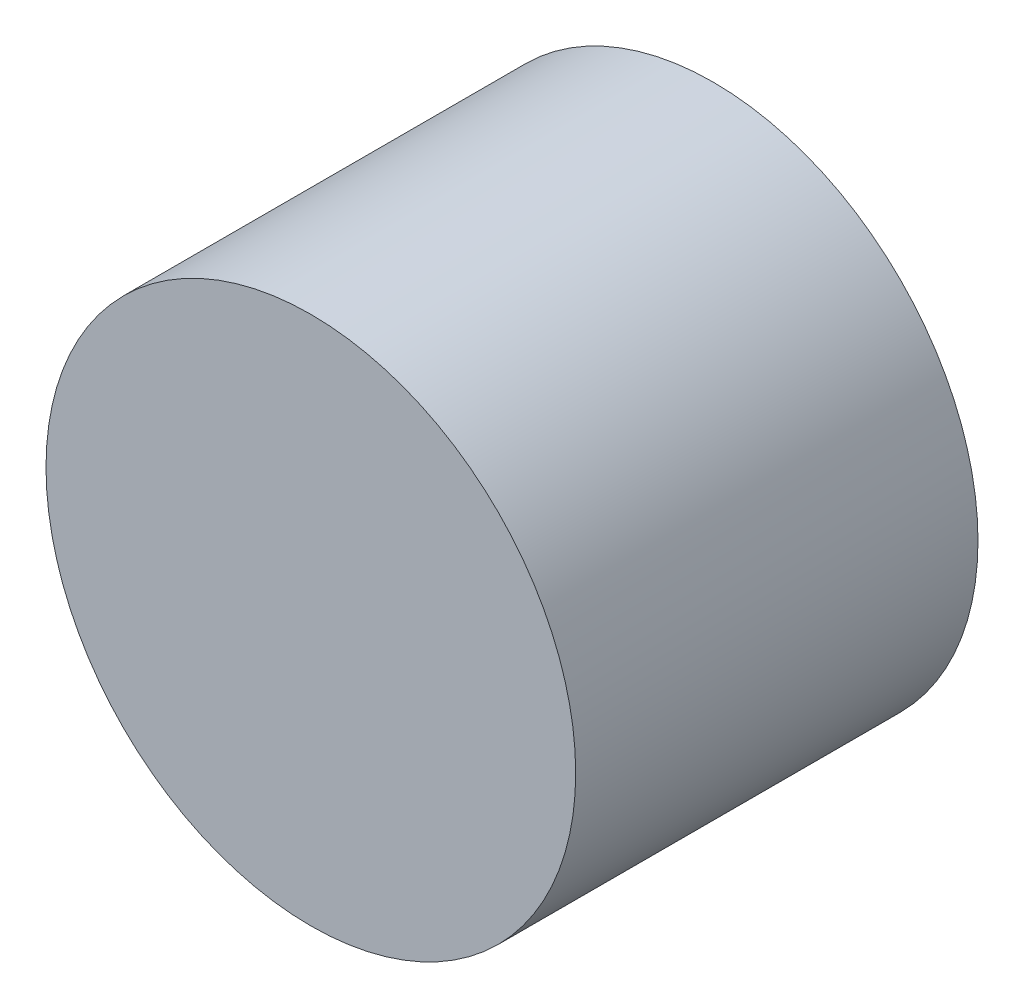
ISO-10303-21;
HEADER;
FILE_DESCRIPTION(('STEP AP214'),'2;1');
FILE_NAME('part.step','',(''),(''),'','','');
FILE_SCHEMA(('AUTOMOTIVE_DESIGN { 1 0 10303 214 1 1 1 1 }'));
ENDSEC;
DATA;
#1=APPLICATION_CONTEXT('core data for automotive mechanical design processes');
#2=APPLICATION_PROTOCOL_DEFINITION('international standard','automotive_design',2000,#1);
#3=PRODUCT_CONTEXT('',#1,'mechanical');
#4=PRODUCT('Part','Part','',(#3));
#5=PRODUCT_RELATED_PRODUCT_CATEGORY('part','',(#4));
#6=PRODUCT_DEFINITION_FORMATION('','',#4);
#7=PRODUCT_DEFINITION_CONTEXT('part definition',#1,'design');
#8=PRODUCT_DEFINITION('design','',#6,#7);
#9=PRODUCT_DEFINITION_SHAPE('','',#8);
#10=(LENGTH_UNIT() NAMED_UNIT(*) SI_UNIT(.MILLI.,.METRE.));
#11=(NAMED_UNIT(*) PLANE_ANGLE_UNIT() SI_UNIT($,.RADIAN.));
#12=(NAMED_UNIT(*) SI_UNIT($,.STERADIAN.) SOLID_ANGLE_UNIT());
#13=UNCERTAINTY_MEASURE_WITH_UNIT(LENGTH_MEASURE(1.E-05),#10,'distance_accuracy_value','');
#14=(GEOMETRIC_REPRESENTATION_CONTEXT(3) GLOBAL_UNCERTAINTY_ASSIGNED_CONTEXT((#13)) GLOBAL_UNIT_ASSIGNED_CONTEXT((#10,
#11,#12)) REPRESENTATION_CONTEXT('',''));
#15=CARTESIAN_POINT('',(0.,0.,0.));
#16=DIRECTION('',(0.,0.,1.));
#17=DIRECTION('',(1.,0.,0.));
#18=AXIS2_PLACEMENT_3D('',#15,#16,#17);
#19=CARTESIAN_POINT('',(0.,0.,2.));
#20=DIRECTION('',(0.,0.,-1.));
#21=DIRECTION('',(-1.,0.,0.));
#22=AXIS2_PLACEMENT_3D('',#19,#20,#21);
#23=CYLINDRICAL_SURFACE('',#22,7.9);
#24=CARTESIAN_POINT('',(0.,0.,2.));
#25=DIRECTION('',(0.,0.,1.));
#26=DIRECTION('',(1.,0.,0.));
#27=AXIS2_PLACEMENT_3D('',#24,#25,#26);
#28=CIRCLE('',#27,7.9);
#29=CARTESIAN_POINT('',(7.9,0.,2.));
#30=VERTEX_POINT('',#29);
#31=EDGE_CURVE('E10',#30,#30,#28,.T.);
#32=ORIENTED_EDGE('',*,*,#31,.F.);
#33=EDGE_LOOP('',(#32));
#34=FACE_BOUND('',#33,.T.);
#35=CARTESIAN_POINT('',(0.,0.,-10.));
#36=DIRECTION('',(0.,0.,-1.));
#37=DIRECTION('',(-1.,0.,0.));
#38=AXIS2_PLACEMENT_3D('',#35,#36,#37);
#39=CIRCLE('',#38,7.9);
#40=CARTESIAN_POINT('',(-7.9,0.,-10.));
#41=VERTEX_POINT('',#40);
#42=EDGE_CURVE('E39',#41,#41,#39,.T.);
#43=ORIENTED_EDGE('',*,*,#42,.F.);
#44=EDGE_LOOP('',(#43));
#45=FACE_BOUND('',#44,.T.);
#46=ADVANCED_FACE('F33',(#34,#45),#23,.T.);
#47=CARTESIAN_POINT('',(0.,0.,2.));
#48=DIRECTION('',(0.,0.,1.));
#49=DIRECTION('',(1.,0.,0.));
#50=AXIS2_PLACEMENT_3D('',#47,#48,#49);
#51=PLANE('',#50);
#52=ORIENTED_EDGE('',*,*,#31,.T.);
#53=EDGE_LOOP('',(#52));
#54=FACE_BOUND('',#53,.T.);
#55=ADVANCED_FACE('F64',(#54),#51,.T.);
#56=CARTESIAN_POINT('',(0.,0.,-10.));
#57=DIRECTION('',(0.,0.,-1.));
#58=DIRECTION('',(-1.,0.,0.));
#59=AXIS2_PLACEMENT_3D('',#56,#57,#58);
#60=PLANE('',#59);
#61=ORIENTED_EDGE('',*,*,#42,.T.);
#62=EDGE_LOOP('',(#61));
#63=FACE_BOUND('',#62,.T.);
#64=CARTESIAN_POINT('',(0.,0.,-10.));
#65=DIRECTION('',(0.,0.,-1.));
#66=DIRECTION('',(-1.,0.,0.));
#67=AXIS2_PLACEMENT_3D('',#64,#65,#66);
#68=CIRCLE('',#67,5.5);
#69=CARTESIAN_POINT('',(-5.5,0.,-10.));
#70=VERTEX_POINT('',#69);
#71=EDGE_CURVE('E43',#70,#70,#68,.T.);
#72=ORIENTED_EDGE('',*,*,#71,.F.);
#73=EDGE_LOOP('',(#72));
#74=FACE_BOUND('',#73,.T.);
#75=ADVANCED_FACE('F57',(#63,#74),#60,.T.);
#76=CARTESIAN_POINT('',(0.,0.,-10.));
#77=DIRECTION('',(0.,0.,1.));
#78=DIRECTION('',(1.,0.,0.));
#79=AXIS2_PLACEMENT_3D('',#76,#77,#78);
#80=CYLINDRICAL_SURFACE('',#79,5.5);
#81=ORIENTED_EDGE('',*,*,#71,.T.);
#82=EDGE_LOOP('',(#81));
#83=FACE_BOUND('',#82,.T.);
#84=CARTESIAN_POINT('',(0.,0.,0.));
#85=DIRECTION('',(0.,0.,-1.));
#86=DIRECTION('',(-1.,0.,0.));
#87=AXIS2_PLACEMENT_3D('',#84,#85,#86);
#88=CIRCLE('',#87,5.5);
#89=CARTESIAN_POINT('',(-5.5,0.,0.));
#90=VERTEX_POINT('',#89);
#91=EDGE_CURVE('E47',#90,#90,#88,.T.);
#92=ORIENTED_EDGE('',*,*,#91,.F.);
#93=EDGE_LOOP('',(#92));
#94=FACE_BOUND('',#93,.T.);
#95=ADVANCED_FACE('F55',(#83,#94),#80,.F.);
#96=CARTESIAN_POINT('',(0.,0.,0.));
#97=DIRECTION('',(0.,0.,1.));
#98=DIRECTION('',(1.,0.,0.));
#99=AXIS2_PLACEMENT_3D('',#96,#97,#98);
#100=PLANE('',#99);
#101=ORIENTED_EDGE('',*,*,#91,.T.);
#102=EDGE_LOOP('',(#101));
#103=FACE_BOUND('',#102,.T.);
#104=ADVANCED_FACE('F53',(#103),#100,.F.);
#105=CLOSED_SHELL('',(#46,#55,#75,#95,#104));
#106=MANIFOLD_SOLID_BREP('B2',#105);
#107=ADVANCED_BREP_SHAPE_REPRESENTATION('',(#18,#106),#14);
#108=SHAPE_DEFINITION_REPRESENTATION(#9,#107);
ENDSEC;
END-ISO-10303-21;
